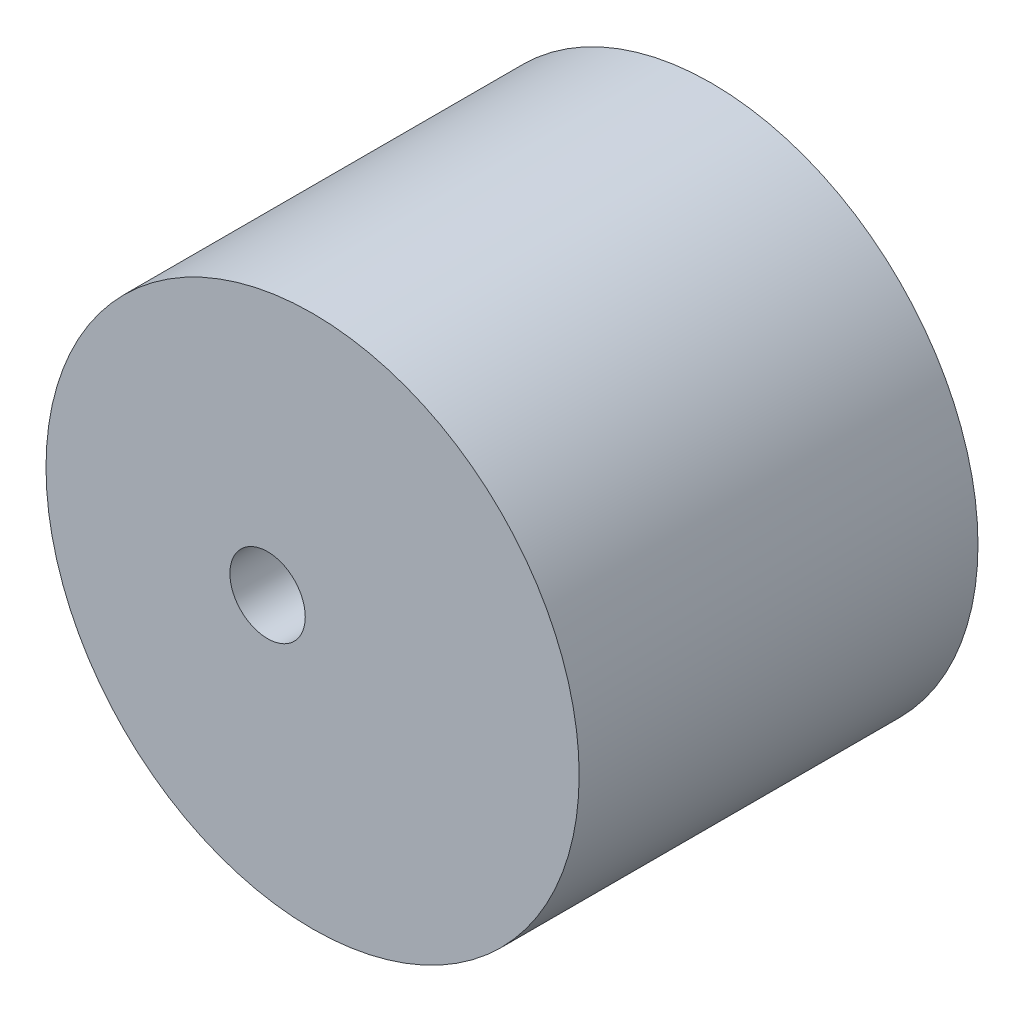
ISO-10303-21;
HEADER;
FILE_DESCRIPTION(('STEP AP214'),'2;1');
FILE_NAME('part.step','',(''),(''),'','','');
FILE_SCHEMA(('AUTOMOTIVE_DESIGN { 1 0 10303 214 1 1 1 1 }'));
ENDSEC;
DATA;
#1=APPLICATION_CONTEXT('core data for automotive mechanical design processes');
#2=APPLICATION_PROTOCOL_DEFINITION('international standard','automotive_design',2000,#1);
#3=PRODUCT_CONTEXT('',#1,'mechanical');
#4=PRODUCT('Part','Part','',(#3));
#5=PRODUCT_RELATED_PRODUCT_CATEGORY('part','',(#4));
#6=PRODUCT_DEFINITION_FORMATION('','',#4);
#7=PRODUCT_DEFINITION_CONTEXT('part definition',#1,'design');
#8=PRODUCT_DEFINITION('design','',#6,#7);
#9=PRODUCT_DEFINITION_SHAPE('','',#8);
#10=(LENGTH_UNIT() NAMED_UNIT(*) SI_UNIT(.MILLI.,.METRE.));
#11=(NAMED_UNIT(*) PLANE_ANGLE_UNIT() SI_UNIT($,.RADIAN.));
#12=(NAMED_UNIT(*) SI_UNIT($,.STERADIAN.) SOLID_ANGLE_UNIT());
#13=UNCERTAINTY_MEASURE_WITH_UNIT(LENGTH_MEASURE(1.E-05),#10,'distance_accuracy_value','');
#14=(GEOMETRIC_REPRESENTATION_CONTEXT(3) GLOBAL_UNCERTAINTY_ASSIGNED_CONTEXT((#13)) GLOBAL_UNIT_ASSIGNED_CONTEXT((#10,
#11,#12)) REPRESENTATION_CONTEXT('',''));
#15=CARTESIAN_POINT('',(0.,0.,0.));
#16=DIRECTION('',(0.,0.,1.));
#17=DIRECTION('',(1.,0.,0.));
#18=AXIS2_PLACEMENT_3D('',#15,#16,#17);
#19=CARTESIAN_POINT('',(0.,0.,35.));
#20=DIRECTION('',(0.,0.,1.));
#21=DIRECTION('',(1.,0.,0.));
#22=AXIS2_PLACEMENT_3D('',#19,#20,#21);
#23=PLANE('',#22);
#24=CARTESIAN_POINT('',(0.,0.,35.));
#25=DIRECTION('',(0.,0.,1.));
#26=DIRECTION('',(1.,0.,0.));
#27=AXIS2_PLACEMENT_3D('',#24,#25,#26);
#28=CIRCLE('',#27,23.39375);
#29=CARTESIAN_POINT('',(23.39375,0.,35.));
#30=VERTEX_POINT('',#29);
#31=EDGE_CURVE('E10',#30,#30,#28,.T.);
#32=ORIENTED_EDGE('',*,*,#31,.T.);
#33=EDGE_LOOP('',(#32));
#34=FACE_BOUND('',#33,.T.);
#35=CARTESIAN_POINT('',(-3.95,0.,35.));
#36=DIRECTION('',(0.,0.,1.));
#37=DIRECTION('',(1.,0.,0.));
#38=AXIS2_PLACEMENT_3D('',#35,#36,#37);
#39=CIRCLE('',#38,3.3085);
#40=CARTESIAN_POINT('',(-0.6415,0.,35.));
#41=VERTEX_POINT('',#40);
#42=EDGE_CURVE('E50',#41,#41,#39,.T.);
#43=ORIENTED_EDGE('',*,*,#42,.F.);
#44=EDGE_LOOP('',(#43));
#45=FACE_BOUND('',#44,.T.);
#46=ADVANCED_FACE('F37',(#34,#45),#23,.T.);
#47=CARTESIAN_POINT('',(0.,0.,0.));
#48=DIRECTION('',(0.,0.,1.));
#49=DIRECTION('',(1.,0.,0.));
#50=AXIS2_PLACEMENT_3D('',#47,#48,#49);
#51=PLANE('',#50);
#52=CARTESIAN_POINT('',(0.,0.,0.));
#53=DIRECTION('',(0.,0.,1.));
#54=DIRECTION('',(1.,0.,0.));
#55=AXIS2_PLACEMENT_3D('',#52,#53,#54);
#56=CIRCLE('',#55,23.39375);
#57=CARTESIAN_POINT('',(23.39375,0.,0.));
#58=VERTEX_POINT('',#57);
#59=EDGE_CURVE('E41',#58,#58,#56,.T.);
#60=ORIENTED_EDGE('',*,*,#59,.F.);
#61=EDGE_LOOP('',(#60));
#62=FACE_BOUND('',#61,.T.);
#63=CARTESIAN_POINT('',(-3.95,0.,0.));
#64=DIRECTION('',(0.,0.,1.));
#65=DIRECTION('',(1.,0.,0.));
#66=AXIS2_PLACEMENT_3D('',#63,#64,#65);
#67=CIRCLE('',#66,3.3085);
#68=CARTESIAN_POINT('',(-0.6415,0.,0.));
#69=VERTEX_POINT('',#68);
#70=EDGE_CURVE('E52',#69,#69,#67,.T.);
#71=ORIENTED_EDGE('',*,*,#70,.T.);
#72=EDGE_LOOP('',(#71));
#73=FACE_BOUND('',#72,.T.);
#74=ADVANCED_FACE('F64',(#62,#73),#51,.F.);
#75=CARTESIAN_POINT('',(0.,0.,35.));
#76=DIRECTION('',(0.,0.,-1.));
#77=DIRECTION('',(-1.,0.,0.));
#78=AXIS2_PLACEMENT_3D('',#75,#76,#77);
#79=CYLINDRICAL_SURFACE('',#78,23.39375);
#80=ORIENTED_EDGE('',*,*,#31,.F.);
#81=EDGE_LOOP('',(#80));
#82=FACE_BOUND('',#81,.T.);
#83=ORIENTED_EDGE('',*,*,#59,.T.);
#84=EDGE_LOOP('',(#83));
#85=FACE_BOUND('',#84,.T.);
#86=ADVANCED_FACE('F39',(#82,#85),#79,.T.);
#87=CARTESIAN_POINT('',(-3.95,0.,35.));
#88=DIRECTION('',(0.,0.,-1.));
#89=DIRECTION('',(-1.,0.,0.));
#90=AXIS2_PLACEMENT_3D('',#87,#88,#89);
#91=CYLINDRICAL_SURFACE('',#90,3.3085);
#92=ORIENTED_EDGE('',*,*,#42,.T.);
#93=EDGE_LOOP('',(#92));
#94=FACE_BOUND('',#93,.T.);
#95=ORIENTED_EDGE('',*,*,#70,.F.);
#96=EDGE_LOOP('',(#95));
#97=FACE_BOUND('',#96,.T.);
#98=ADVANCED_FACE('F60',(#94,#97),#91,.F.);
#99=CLOSED_SHELL('',(#46,#74,#86,#98));
#100=MANIFOLD_SOLID_BREP('B2',#99);
#101=ADVANCED_BREP_SHAPE_REPRESENTATION('',(#18,#100),#14);
#102=SHAPE_DEFINITION_REPRESENTATION(#9,#101);
ENDSEC;
END-ISO-10303-21;
